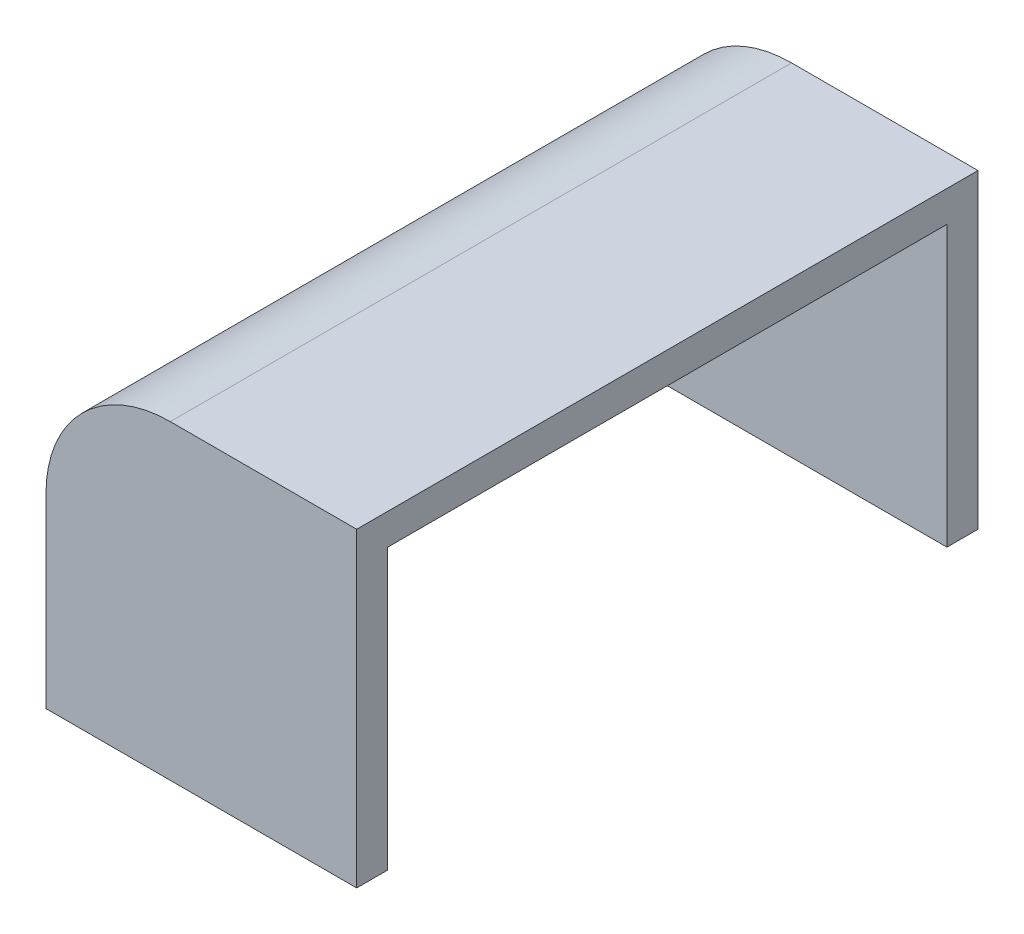
ISO-10303-21;
HEADER;
FILE_DESCRIPTION(('STEP AP214'),'2;1');
FILE_NAME('part.step','',(''),(''),'','','');
FILE_SCHEMA(('AUTOMOTIVE_DESIGN { 1 0 10303 214 1 1 1 1 }'));
ENDSEC;
DATA;
#1=APPLICATION_CONTEXT('core data for automotive mechanical design processes');
#2=APPLICATION_PROTOCOL_DEFINITION('international standard','automotive_design',2000,#1);
#3=PRODUCT_CONTEXT('',#1,'mechanical');
#4=PRODUCT('Part','Part','',(#3));
#5=PRODUCT_RELATED_PRODUCT_CATEGORY('part','',(#4));
#6=PRODUCT_DEFINITION_FORMATION('','',#4);
#7=PRODUCT_DEFINITION_CONTEXT('part definition',#1,'design');
#8=PRODUCT_DEFINITION('design','',#6,#7);
#9=PRODUCT_DEFINITION_SHAPE('','',#8);
#10=(LENGTH_UNIT() NAMED_UNIT(*) SI_UNIT(.MILLI.,.METRE.));
#11=(NAMED_UNIT(*) PLANE_ANGLE_UNIT() SI_UNIT($,.RADIAN.));
#12=(NAMED_UNIT(*) SI_UNIT($,.STERADIAN.) SOLID_ANGLE_UNIT());
#13=UNCERTAINTY_MEASURE_WITH_UNIT(LENGTH_MEASURE(1.E-05),#10,'distance_accuracy_value','');
#14=(GEOMETRIC_REPRESENTATION_CONTEXT(3) GLOBAL_UNCERTAINTY_ASSIGNED_CONTEXT((#13)) GLOBAL_UNIT_ASSIGNED_CONTEXT((#10,
#11,#12)) REPRESENTATION_CONTEXT('',''));
#15=CARTESIAN_POINT('',(0.,0.,0.));
#16=DIRECTION('',(0.,0.,1.));
#17=DIRECTION('',(1.,0.,0.));
#18=AXIS2_PLACEMENT_3D('',#15,#16,#17);
#19=CARTESIAN_POINT('',(-4.5,0.,9.));
#20=DIRECTION('',(0.,1.,0.));
#21=DIRECTION('',(-1.,0.,0.));
#22=AXIS2_PLACEMENT_3D('',#19,#20,#21);
#23=PLANE('',#22);
#24=DIRECTION('',(0.,0.,-1.));
#25=VECTOR('',#24,1.);
#26=CARTESIAN_POINT('',(-5.,0.,9.));
#27=LINE('',#26,#25);
#28=CARTESIAN_POINT('',(-5.,0.,9.5));
#29=VERTEX_POINT('',#28);
#30=CARTESIAN_POINT('',(-5.,0.,-0.5));
#31=VERTEX_POINT('',#30);
#32=EDGE_CURVE('E112',#29,#31,#27,.T.);
#33=ORIENTED_EDGE('',*,*,#32,.T.);
#34=DIRECTION('',(-1.,0.,0.));
#35=VECTOR('',#34,1.);
#36=CARTESIAN_POINT('',(0.,0.,-0.5));
#37=LINE('',#36,#35);
#38=CARTESIAN_POINT('',(0.,0.,-0.5));
#39=VERTEX_POINT('',#38);
#40=EDGE_CURVE('E106',#39,#31,#37,.T.);
#41=ORIENTED_EDGE('',*,*,#40,.F.);
#42=DIRECTION('',(0.,0.,1.));
#43=VECTOR('',#42,1.);
#44=CARTESIAN_POINT('',(0.,0.,-0.5));
#45=LINE('',#44,#43);
#46=CARTESIAN_POINT('',(0.,0.,0.));
#47=VERTEX_POINT('',#46);
#48=EDGE_CURVE('E110',#39,#47,#45,.T.);
#49=ORIENTED_EDGE('',*,*,#48,.T.);
#50=DIRECTION('',(-1.,0.,0.));
#51=VECTOR('',#50,1.);
#52=CARTESIAN_POINT('',(0.,0.,0.));
#53=LINE('',#52,#51);
#54=CARTESIAN_POINT('',(-4.5,0.,0.));
#55=VERTEX_POINT('',#54);
#56=EDGE_CURVE('E126',#47,#55,#53,.T.);
#57=ORIENTED_EDGE('',*,*,#56,.T.);
#58=DIRECTION('',(0.,0.,-1.));
#59=VECTOR('',#58,1.);
#60=CARTESIAN_POINT('',(-4.5,0.,9.));
#61=LINE('',#60,#59);
#62=CARTESIAN_POINT('',(-4.5,0.,9.));
#63=VERTEX_POINT('',#62);
#64=EDGE_CURVE('E11',#63,#55,#61,.T.);
#65=ORIENTED_EDGE('',*,*,#64,.F.);
#66=DIRECTION('',(1.,0.,0.));
#67=VECTOR('',#66,1.);
#68=CARTESIAN_POINT('',(0.,0.,9.));
#69=LINE('',#68,#67);
#70=CARTESIAN_POINT('',(0.,0.,9.));
#71=VERTEX_POINT('',#70);
#72=EDGE_CURVE('E132',#63,#71,#69,.T.);
#73=ORIENTED_EDGE('',*,*,#72,.T.);
#74=DIRECTION('',(0.,0.,-1.));
#75=VECTOR('',#74,1.);
#76=CARTESIAN_POINT('',(0.,0.,9.5));
#77=LINE('',#76,#75);
#78=CARTESIAN_POINT('',(0.,0.,9.5));
#79=VERTEX_POINT('',#78);
#80=EDGE_CURVE('E154',#79,#71,#77,.T.);
#81=ORIENTED_EDGE('',*,*,#80,.F.);
#82=DIRECTION('',(1.,0.,0.));
#83=VECTOR('',#82,1.);
#84=CARTESIAN_POINT('',(0.,0.,9.5));
#85=LINE('',#84,#83);
#86=EDGE_CURVE('E144',#29,#79,#85,.T.);
#87=ORIENTED_EDGE('',*,*,#86,.F.);
#88=EDGE_LOOP('',(#33,#41,#49,#57,#65,#73,#81,#87));
#89=FACE_BOUND('',#88,.T.);
#90=ADVANCED_FACE('F33',(#89),#23,.F.);
#91=CARTESIAN_POINT('',(-4.5,2.5,9.));
#92=DIRECTION('',(-1.,0.,0.));
#93=DIRECTION('',(0.,-1.,0.));
#94=AXIS2_PLACEMENT_3D('',#91,#92,#93);
#95=PLANE('',#94);
#96=DIRECTION('',(0.,1.,0.));
#97=VECTOR('',#96,1.);
#98=CARTESIAN_POINT('',(-4.5,2.5,0.));
#99=LINE('',#98,#97);
#100=CARTESIAN_POINT('',(-4.5,2.5,0.));
#101=VERTEX_POINT('',#100);
#102=EDGE_CURVE('E160',#55,#101,#99,.T.);
#103=ORIENTED_EDGE('',*,*,#102,.T.);
#104=DIRECTION('',(0.,0.,-1.));
#105=VECTOR('',#104,1.);
#106=CARTESIAN_POINT('',(-4.5,2.5,9.));
#107=LINE('',#106,#105);
#108=CARTESIAN_POINT('',(-4.5,2.5,9.));
#109=VERTEX_POINT('',#108);
#110=EDGE_CURVE('E41',#109,#101,#107,.T.);
#111=ORIENTED_EDGE('',*,*,#110,.F.);
#112=DIRECTION('',(0.,1.,0.));
#113=VECTOR('',#112,1.);
#114=CARTESIAN_POINT('',(-4.5,2.5,9.));
#115=LINE('',#114,#113);
#116=EDGE_CURVE('E161',#63,#109,#115,.T.);
#117=ORIENTED_EDGE('',*,*,#116,.F.);
#118=ORIENTED_EDGE('',*,*,#64,.T.);
#119=EDGE_LOOP('',(#103,#111,#117,#118));
#120=FACE_BOUND('',#119,.T.);
#121=ADVANCED_FACE('F190',(#120),#95,.F.);
#122=CARTESIAN_POINT('',(-2.5,2.5,9.));
#123=DIRECTION('',(0.,0.,-1.));
#124=DIRECTION('',(-1.,0.,0.));
#125=AXIS2_PLACEMENT_3D('',#122,#123,#124);
#126=CYLINDRICAL_SURFACE('',#125,2.);
#127=CARTESIAN_POINT('',(-2.5,2.5,0.));
#128=DIRECTION('',(0.,0.,-1.));
#129=DIRECTION('',(-1.,0.,0.));
#130=AXIS2_PLACEMENT_3D('',#127,#128,#129);
#131=CIRCLE('',#130,2.);
#132=CARTESIAN_POINT('',(-2.5,4.5,0.));
#133=VERTEX_POINT('',#132);
#134=EDGE_CURVE('E173',#101,#133,#131,.T.);
#135=ORIENTED_EDGE('',*,*,#134,.T.);
#136=DIRECTION('',(0.,0.,-1.));
#137=VECTOR('',#136,1.);
#138=CARTESIAN_POINT('',(-2.5,4.5,9.));
#139=LINE('',#138,#137);
#140=CARTESIAN_POINT('',(-2.5,4.5,9.));
#141=VERTEX_POINT('',#140);
#142=EDGE_CURVE('E48',#141,#133,#139,.T.);
#143=ORIENTED_EDGE('',*,*,#142,.F.);
#144=CARTESIAN_POINT('',(-2.5,2.5,9.));
#145=DIRECTION('',(0.,0.,-1.));
#146=DIRECTION('',(-1.,0.,0.));
#147=AXIS2_PLACEMENT_3D('',#144,#145,#146);
#148=CIRCLE('',#147,2.);
#149=EDGE_CURVE('E164',#109,#141,#148,.T.);
#150=ORIENTED_EDGE('',*,*,#149,.F.);
#151=ORIENTED_EDGE('',*,*,#110,.T.);
#152=EDGE_LOOP('',(#135,#143,#150,#151));
#153=FACE_BOUND('',#152,.T.);
#154=ADVANCED_FACE('F187',(#153),#126,.F.);
#155=CARTESIAN_POINT('',(0.,4.5,9.));
#156=DIRECTION('',(0.,1.,0.));
#157=DIRECTION('',(0.,0.,1.));
#158=AXIS2_PLACEMENT_3D('',#155,#156,#157);
#159=PLANE('',#158);
#160=DIRECTION('',(1.,0.,0.));
#161=VECTOR('',#160,1.);
#162=CARTESIAN_POINT('',(0.,4.5,0.));
#163=LINE('',#162,#161);
#164=CARTESIAN_POINT('',(0.,4.5,0.));
#165=VERTEX_POINT('',#164);
#166=EDGE_CURVE('E165',#133,#165,#163,.T.);
#167=ORIENTED_EDGE('',*,*,#166,.T.);
#168=DIRECTION('',(0.,0.,-1.));
#169=VECTOR('',#168,1.);
#170=CARTESIAN_POINT('',(0.,4.5,9.));
#171=LINE('',#170,#169);
#172=CARTESIAN_POINT('',(0.,4.5,9.));
#173=VERTEX_POINT('',#172);
#174=EDGE_CURVE('E184',#173,#165,#171,.T.);
#175=ORIENTED_EDGE('',*,*,#174,.F.);
#176=DIRECTION('',(1.,0.,0.));
#177=VECTOR('',#176,1.);
#178=CARTESIAN_POINT('',(0.,4.5,9.));
#179=LINE('',#178,#177);
#180=EDGE_CURVE('E168',#141,#173,#179,.T.);
#181=ORIENTED_EDGE('',*,*,#180,.F.);
#182=ORIENTED_EDGE('',*,*,#142,.T.);
#183=EDGE_LOOP('',(#167,#175,#181,#182));
#184=FACE_BOUND('',#183,.T.);
#185=ADVANCED_FACE('F214',(#184),#159,.F.);
#186=CARTESIAN_POINT('',(0.,5.,9.));
#187=DIRECTION('',(-1.,0.,0.));
#188=DIRECTION('',(0.,-1.,0.));
#189=AXIS2_PLACEMENT_3D('',#186,#187,#188);
#190=PLANE('',#189);
#191=ORIENTED_EDGE('',*,*,#174,.T.);
#192=DIRECTION('',(0.,-1.,0.));
#193=VECTOR('',#192,1.);
#194=CARTESIAN_POINT('',(0.,5.,0.));
#195=LINE('',#194,#193);
#196=EDGE_CURVE('E130',#165,#47,#195,.T.);
#197=ORIENTED_EDGE('',*,*,#196,.T.);
#198=ORIENTED_EDGE('',*,*,#48,.F.);
#199=DIRECTION('',(0.,-1.,0.));
#200=VECTOR('',#199,1.);
#201=CARTESIAN_POINT('',(0.,5.,-0.5));
#202=LINE('',#201,#200);
#203=CARTESIAN_POINT('',(0.,5.,-0.5));
#204=VERTEX_POINT('',#203);
#205=EDGE_CURVE('E117',#204,#39,#202,.T.);
#206=ORIENTED_EDGE('',*,*,#205,.F.);
#207=DIRECTION('',(0.,0.,-1.));
#208=VECTOR('',#207,1.);
#209=CARTESIAN_POINT('',(0.,5.,9.));
#210=LINE('',#209,#208);
#211=CARTESIAN_POINT('',(0.,5.,9.5));
#212=VERTEX_POINT('',#211);
#213=EDGE_CURVE('E182',#212,#204,#210,.T.);
#214=ORIENTED_EDGE('',*,*,#213,.F.);
#215=DIRECTION('',(0.,1.,0.));
#216=VECTOR('',#215,1.);
#217=CARTESIAN_POINT('',(0.,5.,9.5));
#218=LINE('',#217,#216);
#219=EDGE_CURVE('E146',#79,#212,#218,.T.);
#220=ORIENTED_EDGE('',*,*,#219,.F.);
#221=ORIENTED_EDGE('',*,*,#80,.T.);
#222=DIRECTION('',(0.,1.,0.));
#223=VECTOR('',#222,1.);
#224=CARTESIAN_POINT('',(0.,5.,9.));
#225=LINE('',#224,#223);
#226=EDGE_CURVE('E134',#71,#173,#225,.T.);
#227=ORIENTED_EDGE('',*,*,#226,.T.);
#228=EDGE_LOOP('',(#191,#197,#198,#206,#214,#220,#221,#227));
#229=FACE_BOUND('',#228,.T.);
#230=ADVANCED_FACE('F129',(#229),#190,.F.);
#231=CARTESIAN_POINT('',(-3.,5.,9.));
#232=DIRECTION('',(0.,-1.,0.));
#233=DIRECTION('',(1.,0.,0.));
#234=AXIS2_PLACEMENT_3D('',#231,#232,#233);
#235=PLANE('',#234);
#236=ORIENTED_EDGE('',*,*,#213,.T.);
#237=DIRECTION('',(1.,0.,0.));
#238=VECTOR('',#237,1.);
#239=CARTESIAN_POINT('',(0.,5.,-0.5));
#240=LINE('',#239,#238);
#241=CARTESIAN_POINT('',(-3.,5.,-0.5));
#242=VERTEX_POINT('',#241);
#243=EDGE_CURVE('E124',#242,#204,#240,.T.);
#244=ORIENTED_EDGE('',*,*,#243,.F.);
#245=DIRECTION('',(0.,0.,-1.));
#246=VECTOR('',#245,1.);
#247=CARTESIAN_POINT('',(-3.,5.,9.));
#248=LINE('',#247,#246);
#249=CARTESIAN_POINT('',(-3.,5.,9.5));
#250=VERTEX_POINT('',#249);
#251=EDGE_CURVE('E180',#250,#242,#248,.T.);
#252=ORIENTED_EDGE('',*,*,#251,.F.);
#253=DIRECTION('',(-1.,0.,0.));
#254=VECTOR('',#253,1.);
#255=CARTESIAN_POINT('',(0.,5.,9.5));
#256=LINE('',#255,#254);
#257=EDGE_CURVE('E149',#212,#250,#256,.T.);
#258=ORIENTED_EDGE('',*,*,#257,.F.);
#259=EDGE_LOOP('',(#236,#244,#252,#258));
#260=FACE_BOUND('',#259,.T.);
#261=ADVANCED_FACE('F204',(#260),#235,.F.);
#262=CARTESIAN_POINT('',(-3.,3.,9.));
#263=DIRECTION('',(0.,0.,-1.));
#264=DIRECTION('',(-1.,0.,0.));
#265=AXIS2_PLACEMENT_3D('',#262,#263,#264);
#266=CYLINDRICAL_SURFACE('',#265,2.);
#267=ORIENTED_EDGE('',*,*,#251,.T.);
#268=CARTESIAN_POINT('',(-3.,3.,-0.5));
#269=DIRECTION('',(0.,0.,-1.));
#270=DIRECTION('',(-1.,0.,0.));
#271=AXIS2_PLACEMENT_3D('',#268,#269,#270);
#272=CIRCLE('',#271,2.);
#273=CARTESIAN_POINT('',(-5.,3.,-0.5));
#274=VERTEX_POINT('',#273);
#275=EDGE_CURVE('E136',#274,#242,#272,.T.);
#276=ORIENTED_EDGE('',*,*,#275,.F.);
#277=DIRECTION('',(0.,0.,-1.));
#278=VECTOR('',#277,1.);
#279=CARTESIAN_POINT('',(-5.,3.,9.));
#280=LINE('',#279,#278);
#281=CARTESIAN_POINT('',(-5.,3.,9.5));
#282=VERTEX_POINT('',#281);
#283=EDGE_CURVE('E178',#282,#274,#280,.T.);
#284=ORIENTED_EDGE('',*,*,#283,.F.);
#285=CARTESIAN_POINT('',(-3.,3.,9.5));
#286=DIRECTION('',(0.,0.,1.));
#287=DIRECTION('',(1.,0.,0.));
#288=AXIS2_PLACEMENT_3D('',#285,#286,#287);
#289=CIRCLE('',#288,2.);
#290=EDGE_CURVE('E152',#250,#282,#289,.T.);
#291=ORIENTED_EDGE('',*,*,#290,.F.);
#292=EDGE_LOOP('',(#267,#276,#284,#291));
#293=FACE_BOUND('',#292,.T.);
#294=ADVANCED_FACE('F200',(#293),#266,.T.);
#295=CARTESIAN_POINT('',(-5.,0.,9.));
#296=DIRECTION('',(1.,0.,0.));
#297=DIRECTION('',(0.,0.,-1.));
#298=AXIS2_PLACEMENT_3D('',#295,#296,#297);
#299=PLANE('',#298);
#300=ORIENTED_EDGE('',*,*,#283,.T.);
#301=DIRECTION('',(0.,1.,0.));
#302=VECTOR('',#301,1.);
#303=CARTESIAN_POINT('',(-5.,3.,-0.5));
#304=LINE('',#303,#302);
#305=EDGE_CURVE('E116',#31,#274,#304,.T.);
#306=ORIENTED_EDGE('',*,*,#305,.F.);
#307=ORIENTED_EDGE('',*,*,#32,.F.);
#308=DIRECTION('',(0.,-1.,0.));
#309=VECTOR('',#308,1.);
#310=CARTESIAN_POINT('',(-5.,3.,9.5));
#311=LINE('',#310,#309);
#312=EDGE_CURVE('E141',#282,#29,#311,.T.);
#313=ORIENTED_EDGE('',*,*,#312,.F.);
#314=EDGE_LOOP('',(#300,#306,#307,#313));
#315=FACE_BOUND('',#314,.T.);
#316=ADVANCED_FACE('F264',(#315),#299,.F.);
#317=CARTESIAN_POINT('',(-3.,3.,9.));
#318=DIRECTION('',(0.,0.,1.));
#319=DIRECTION('',(1.,0.,0.));
#320=AXIS2_PLACEMENT_3D('',#317,#318,#319);
#321=PLANE('',#320);
#322=ORIENTED_EDGE('',*,*,#72,.F.);
#323=ORIENTED_EDGE('',*,*,#116,.T.);
#324=ORIENTED_EDGE('',*,*,#149,.T.);
#325=ORIENTED_EDGE('',*,*,#180,.T.);
#326=ORIENTED_EDGE('',*,*,#226,.F.);
#327=EDGE_LOOP('',(#322,#323,#324,#325,#326));
#328=FACE_BOUND('',#327,.T.);
#329=ADVANCED_FACE('F212',(#328),#321,.F.);
#330=CARTESIAN_POINT('',(-3.,3.,9.5));
#331=DIRECTION('',(0.,0.,1.));
#332=DIRECTION('',(1.,0.,0.));
#333=AXIS2_PLACEMENT_3D('',#330,#331,#332);
#334=PLANE('',#333);
#335=ORIENTED_EDGE('',*,*,#312,.T.);
#336=ORIENTED_EDGE('',*,*,#86,.T.);
#337=ORIENTED_EDGE('',*,*,#219,.T.);
#338=ORIENTED_EDGE('',*,*,#257,.T.);
#339=ORIENTED_EDGE('',*,*,#290,.T.);
#340=EDGE_LOOP('',(#335,#336,#337,#338,#339));
#341=FACE_BOUND('',#340,.T.);
#342=ADVANCED_FACE('F206',(#341),#334,.T.);
#343=CARTESIAN_POINT('',(-3.,3.,-0.5));
#344=DIRECTION('',(0.,0.,-1.));
#345=DIRECTION('',(-1.,0.,0.));
#346=AXIS2_PLACEMENT_3D('',#343,#344,#345);
#347=PLANE('',#346);
#348=ORIENTED_EDGE('',*,*,#205,.T.);
#349=ORIENTED_EDGE('',*,*,#40,.T.);
#350=ORIENTED_EDGE('',*,*,#305,.T.);
#351=ORIENTED_EDGE('',*,*,#275,.T.);
#352=ORIENTED_EDGE('',*,*,#243,.T.);
#353=EDGE_LOOP('',(#348,#349,#350,#351,#352));
#354=FACE_BOUND('',#353,.T.);
#355=ADVANCED_FACE('F121',(#354),#347,.T.);
#356=CARTESIAN_POINT('',(-3.,3.,0.));
#357=DIRECTION('',(0.,0.,-1.));
#358=DIRECTION('',(-1.,0.,0.));
#359=AXIS2_PLACEMENT_3D('',#356,#357,#358);
#360=PLANE('',#359);
#361=ORIENTED_EDGE('',*,*,#166,.F.);
#362=ORIENTED_EDGE('',*,*,#134,.F.);
#363=ORIENTED_EDGE('',*,*,#102,.F.);
#364=ORIENTED_EDGE('',*,*,#56,.F.);
#365=ORIENTED_EDGE('',*,*,#196,.F.);
#366=EDGE_LOOP('',(#361,#362,#363,#364,#365));
#367=FACE_BOUND('',#366,.T.);
#368=ADVANCED_FACE('F193',(#367),#360,.F.);
#369=CLOSED_SHELL('',(#90,#121,#154,#185,#230,#261,#294,#316,#329,#342,#355,#368));
#370=MANIFOLD_SOLID_BREP('B2',#369);
#371=ADVANCED_BREP_SHAPE_REPRESENTATION('',(#18,#370),#14);
#372=SHAPE_DEFINITION_REPRESENTATION(#9,#371);
ENDSEC;
END-ISO-10303-21;
